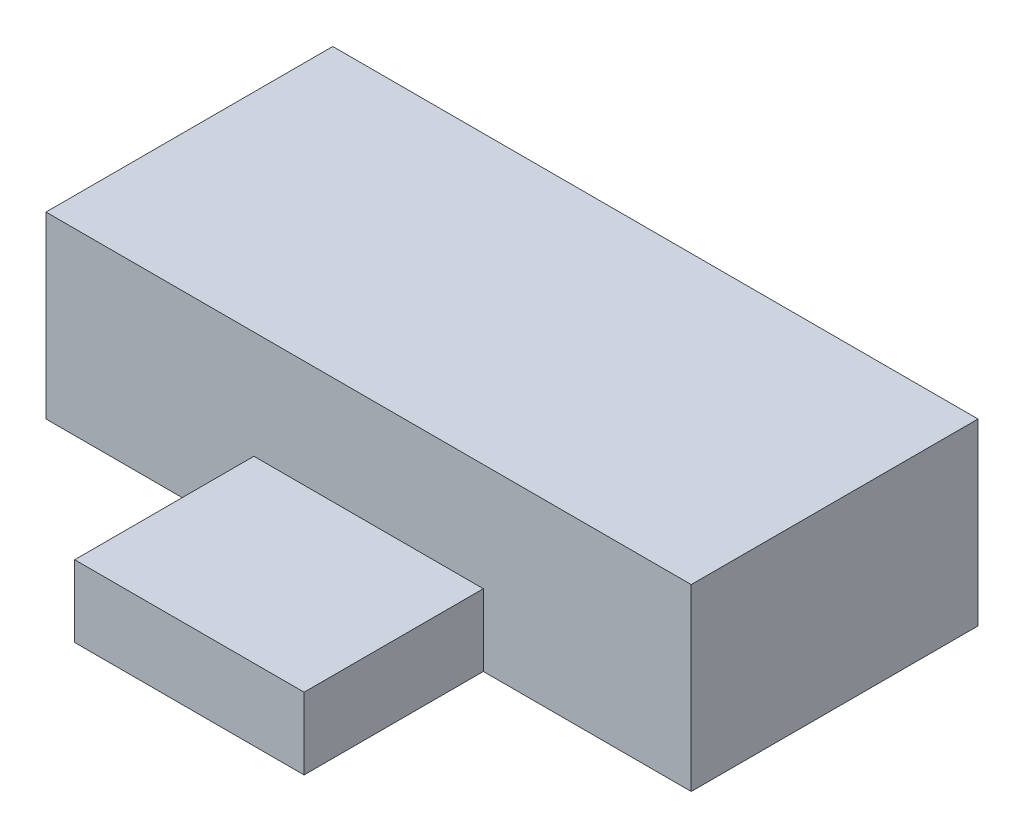
ISO-10303-21;
HEADER;
FILE_DESCRIPTION(('STEP AP214'),'2;1');
FILE_NAME('part.step','',(''),(''),'','','');
FILE_SCHEMA(('AUTOMOTIVE_DESIGN { 1 0 10303 214 1 1 1 1 }'));
ENDSEC;
DATA;
#1=APPLICATION_CONTEXT('core data for automotive mechanical design processes');
#2=APPLICATION_PROTOCOL_DEFINITION('international standard','automotive_design',2000,#1);
#3=PRODUCT_CONTEXT('',#1,'mechanical');
#4=PRODUCT('Part','Part','',(#3));
#5=PRODUCT_RELATED_PRODUCT_CATEGORY('part','',(#4));
#6=PRODUCT_DEFINITION_FORMATION('','',#4);
#7=PRODUCT_DEFINITION_CONTEXT('part definition',#1,'design');
#8=PRODUCT_DEFINITION('design','',#6,#7);
#9=PRODUCT_DEFINITION_SHAPE('','',#8);
#10=(LENGTH_UNIT() NAMED_UNIT(*) SI_UNIT(.MILLI.,.METRE.));
#11=(NAMED_UNIT(*) PLANE_ANGLE_UNIT() SI_UNIT($,.RADIAN.));
#12=(NAMED_UNIT(*) SI_UNIT($,.STERADIAN.) SOLID_ANGLE_UNIT());
#13=UNCERTAINTY_MEASURE_WITH_UNIT(LENGTH_MEASURE(1.E-05),#10,'distance_accuracy_value','');
#14=(GEOMETRIC_REPRESENTATION_CONTEXT(3) GLOBAL_UNCERTAINTY_ASSIGNED_CONTEXT((#13)) GLOBAL_UNIT_ASSIGNED_CONTEXT((#10,
#11,#12)) REPRESENTATION_CONTEXT('',''));
#15=CARTESIAN_POINT('',(0.,0.,0.));
#16=DIRECTION('',(0.,0.,1.));
#17=DIRECTION('',(1.,0.,0.));
#18=AXIS2_PLACEMENT_3D('',#15,#16,#17);
#19=CARTESIAN_POINT('',(-9.,5.,4.));
#20=DIRECTION('',(0.,0.,-1.));
#21=DIRECTION('',(-1.,0.,0.));
#22=AXIS2_PLACEMENT_3D('',#19,#20,#21);
#23=PLANE('',#22);
#24=DIRECTION('',(0.,1.,0.));
#25=VECTOR('',#24,1.);
#26=CARTESIAN_POINT('',(3.2,2.,4.));
#27=LINE('',#26,#25);
#28=CARTESIAN_POINT('',(3.2,0.,4.));
#29=VERTEX_POINT('',#28);
#30=CARTESIAN_POINT('',(3.2,2.,4.));
#31=VERTEX_POINT('',#30);
#32=EDGE_CURVE('E55',#29,#31,#27,.T.);
#33=ORIENTED_EDGE('',*,*,#32,.F.);
#34=DIRECTION('',(1.,0.,0.));
#35=VECTOR('',#34,1.);
#36=CARTESIAN_POINT('',(-9.,0.,4.));
#37=LINE('',#36,#35);
#38=CARTESIAN_POINT('',(9.,0.,4.));
#39=VERTEX_POINT('',#38);
#40=EDGE_CURVE('E143',#29,#39,#37,.T.);
#41=ORIENTED_EDGE('',*,*,#40,.T.);
#42=DIRECTION('',(0.,-1.,0.));
#43=VECTOR('',#42,1.);
#44=CARTESIAN_POINT('',(9.,5.,4.));
#45=LINE('',#44,#43);
#46=CARTESIAN_POINT('',(9.,5.,4.));
#47=VERTEX_POINT('',#46);
#48=EDGE_CURVE('E138',#47,#39,#45,.T.);
#49=ORIENTED_EDGE('',*,*,#48,.F.);
#50=DIRECTION('',(1.,0.,0.));
#51=VECTOR('',#50,1.);
#52=CARTESIAN_POINT('',(-9.,5.,4.));
#53=LINE('',#52,#51);
#54=CARTESIAN_POINT('',(-9.,5.,4.));
#55=VERTEX_POINT('',#54);
#56=EDGE_CURVE('E137',#55,#47,#53,.T.);
#57=ORIENTED_EDGE('',*,*,#56,.F.);
#58=DIRECTION('',(0.,-1.,0.));
#59=VECTOR('',#58,1.);
#60=CARTESIAN_POINT('',(-9.,5.,4.));
#61=LINE('',#60,#59);
#62=CARTESIAN_POINT('',(-9.,0.,4.));
#63=VERTEX_POINT('',#62);
#64=EDGE_CURVE('E153',#55,#63,#61,.T.);
#65=ORIENTED_EDGE('',*,*,#64,.T.);
#66=CARTESIAN_POINT('',(-3.2,0.,4.));
#67=VERTEX_POINT('',#66);
#68=EDGE_CURVE('E133',#63,#67,#37,.T.);
#69=ORIENTED_EDGE('',*,*,#68,.T.);
#70=DIRECTION('',(0.,-1.,0.));
#71=VECTOR('',#70,1.);
#72=CARTESIAN_POINT('',(-3.2,2.,4.));
#73=LINE('',#72,#71);
#74=CARTESIAN_POINT('',(-3.2,2.,4.));
#75=VERTEX_POINT('',#74);
#76=EDGE_CURVE('E117',#75,#67,#73,.T.);
#77=ORIENTED_EDGE('',*,*,#76,.F.);
#78=DIRECTION('',(-1.,0.,0.));
#79=VECTOR('',#78,1.);
#80=CARTESIAN_POINT('',(-3.2,2.,4.));
#81=LINE('',#80,#79);
#82=EDGE_CURVE('E50',#31,#75,#81,.T.);
#83=ORIENTED_EDGE('',*,*,#82,.F.);
#84=EDGE_LOOP('',(#33,#41,#49,#57,#65,#69,#77,#83));
#85=FACE_BOUND('',#84,.T.);
#86=ADVANCED_FACE('F33',(#85),#23,.F.);
#87=CARTESIAN_POINT('',(9.,5.,-4.));
#88=DIRECTION('',(-1.,0.,0.));
#89=DIRECTION('',(0.,0.,1.));
#90=AXIS2_PLACEMENT_3D('',#87,#88,#89);
#91=PLANE('',#90);
#92=DIRECTION('',(0.,0.,-1.));
#93=VECTOR('',#92,1.);
#94=CARTESIAN_POINT('',(9.,0.,-4.));
#95=LINE('',#94,#93);
#96=CARTESIAN_POINT('',(9.,0.,-4.));
#97=VERTEX_POINT('',#96);
#98=EDGE_CURVE('E120',#39,#97,#95,.T.);
#99=ORIENTED_EDGE('',*,*,#98,.T.);
#100=DIRECTION('',(0.,-1.,0.));
#101=VECTOR('',#100,1.);
#102=CARTESIAN_POINT('',(9.,5.,-4.));
#103=LINE('',#102,#101);
#104=CARTESIAN_POINT('',(9.,5.,-4.));
#105=VERTEX_POINT('',#104);
#106=EDGE_CURVE('E11',#105,#97,#103,.T.);
#107=ORIENTED_EDGE('',*,*,#106,.F.);
#108=DIRECTION('',(0.,0.,-1.));
#109=VECTOR('',#108,1.);
#110=CARTESIAN_POINT('',(9.,5.,-4.));
#111=LINE('',#110,#109);
#112=EDGE_CURVE('E129',#47,#105,#111,.T.);
#113=ORIENTED_EDGE('',*,*,#112,.F.);
#114=ORIENTED_EDGE('',*,*,#48,.T.);
#115=EDGE_LOOP('',(#99,#107,#113,#114));
#116=FACE_BOUND('',#115,.T.);
#117=ADVANCED_FACE('F35',(#116),#91,.F.);
#118=CARTESIAN_POINT('',(-9.,5.,-4.));
#119=DIRECTION('',(0.,0.,1.));
#120=DIRECTION('',(1.,0.,0.));
#121=AXIS2_PLACEMENT_3D('',#118,#119,#120);
#122=PLANE('',#121);
#123=DIRECTION('',(-1.,0.,0.));
#124=VECTOR('',#123,1.);
#125=CARTESIAN_POINT('',(-9.,0.,-4.));
#126=LINE('',#125,#124);
#127=CARTESIAN_POINT('',(-9.,0.,-4.));
#128=VERTEX_POINT('',#127);
#129=EDGE_CURVE('E123',#97,#128,#126,.T.);
#130=ORIENTED_EDGE('',*,*,#129,.T.);
#131=DIRECTION('',(0.,-1.,0.));
#132=VECTOR('',#131,1.);
#133=CARTESIAN_POINT('',(-9.,5.,-4.));
#134=LINE('',#133,#132);
#135=CARTESIAN_POINT('',(-9.,5.,-4.));
#136=VERTEX_POINT('',#135);
#137=EDGE_CURVE('E42',#136,#128,#134,.T.);
#138=ORIENTED_EDGE('',*,*,#137,.F.);
#139=DIRECTION('',(-1.,0.,0.));
#140=VECTOR('',#139,1.);
#141=CARTESIAN_POINT('',(-9.,5.,-4.));
#142=LINE('',#141,#140);
#143=EDGE_CURVE('E132',#105,#136,#142,.T.);
#144=ORIENTED_EDGE('',*,*,#143,.F.);
#145=ORIENTED_EDGE('',*,*,#106,.T.);
#146=EDGE_LOOP('',(#130,#138,#144,#145));
#147=FACE_BOUND('',#146,.T.);
#148=ADVANCED_FACE('F169',(#147),#122,.F.);
#149=CARTESIAN_POINT('',(-9.,5.,-4.));
#150=DIRECTION('',(1.,0.,0.));
#151=DIRECTION('',(0.,0.,-1.));
#152=AXIS2_PLACEMENT_3D('',#149,#150,#151);
#153=PLANE('',#152);
#154=DIRECTION('',(0.,0.,1.));
#155=VECTOR('',#154,1.);
#156=CARTESIAN_POINT('',(-9.,0.,-4.));
#157=LINE('',#156,#155);
#158=EDGE_CURVE('E141',#128,#63,#157,.T.);
#159=ORIENTED_EDGE('',*,*,#158,.T.);
#160=ORIENTED_EDGE('',*,*,#64,.F.);
#161=DIRECTION('',(0.,0.,1.));
#162=VECTOR('',#161,1.);
#163=CARTESIAN_POINT('',(-9.,5.,-4.));
#164=LINE('',#163,#162);
#165=EDGE_CURVE('E135',#136,#55,#164,.T.);
#166=ORIENTED_EDGE('',*,*,#165,.F.);
#167=ORIENTED_EDGE('',*,*,#137,.T.);
#168=EDGE_LOOP('',(#159,#160,#166,#167));
#169=FACE_BOUND('',#168,.T.);
#170=ADVANCED_FACE('F181',(#169),#153,.F.);
#171=CARTESIAN_POINT('',(0.,5.,0.));
#172=DIRECTION('',(0.,1.,0.));
#173=DIRECTION('',(0.,0.,1.));
#174=AXIS2_PLACEMENT_3D('',#171,#172,#173);
#175=PLANE('',#174);
#176=ORIENTED_EDGE('',*,*,#112,.T.);
#177=ORIENTED_EDGE('',*,*,#143,.T.);
#178=ORIENTED_EDGE('',*,*,#165,.T.);
#179=ORIENTED_EDGE('',*,*,#56,.T.);
#180=EDGE_LOOP('',(#176,#177,#178,#179));
#181=FACE_BOUND('',#180,.T.);
#182=ADVANCED_FACE('F172',(#181),#175,.T.);
#183=CARTESIAN_POINT('',(0.,0.,0.));
#184=DIRECTION('',(0.,1.,0.));
#185=DIRECTION('',(0.,0.,1.));
#186=AXIS2_PLACEMENT_3D('',#183,#184,#185);
#187=PLANE('',#186);
#188=ORIENTED_EDGE('',*,*,#98,.F.);
#189=ORIENTED_EDGE('',*,*,#40,.F.);
#190=DIRECTION('',(0.,0.,-1.));
#191=VECTOR('',#190,1.);
#192=CARTESIAN_POINT('',(3.2,0.,9.));
#193=LINE('',#192,#191);
#194=CARTESIAN_POINT('',(3.2,0.,9.));
#195=VERTEX_POINT('',#194);
#196=EDGE_CURVE('E262',#195,#29,#193,.T.);
#197=ORIENTED_EDGE('',*,*,#196,.F.);
#198=DIRECTION('',(1.,0.,0.));
#199=VECTOR('',#198,1.);
#200=CARTESIAN_POINT('',(-3.2,0.,9.));
#201=LINE('',#200,#199);
#202=CARTESIAN_POINT('',(-3.2,0.,9.));
#203=VERTEX_POINT('',#202);
#204=EDGE_CURVE('E113',#203,#195,#201,.T.);
#205=ORIENTED_EDGE('',*,*,#204,.F.);
#206=DIRECTION('',(0.,0.,-1.));
#207=VECTOR('',#206,1.);
#208=CARTESIAN_POINT('',(-3.2,0.,9.));
#209=LINE('',#208,#207);
#210=EDGE_CURVE('E125',#203,#67,#209,.T.);
#211=ORIENTED_EDGE('',*,*,#210,.T.);
#212=ORIENTED_EDGE('',*,*,#68,.F.);
#213=ORIENTED_EDGE('',*,*,#158,.F.);
#214=ORIENTED_EDGE('',*,*,#129,.F.);
#215=EDGE_LOOP('',(#188,#189,#197,#205,#211,#212,#213,#214));
#216=FACE_BOUND('',#215,.T.);
#217=ADVANCED_FACE('F165',(#216),#187,.F.);
#218=CARTESIAN_POINT('',(3.2,2.,9.));
#219=DIRECTION('',(-1.,0.,0.));
#220=DIRECTION('',(0.,-1.,0.));
#221=AXIS2_PLACEMENT_3D('',#218,#219,#220);
#222=PLANE('',#221);
#223=ORIENTED_EDGE('',*,*,#32,.T.);
#224=DIRECTION('',(0.,0.,-1.));
#225=VECTOR('',#224,1.);
#226=CARTESIAN_POINT('',(3.2,2.,9.));
#227=LINE('',#226,#225);
#228=CARTESIAN_POINT('',(3.2,2.,9.));
#229=VERTEX_POINT('',#228);
#230=EDGE_CURVE('E102',#229,#31,#227,.T.);
#231=ORIENTED_EDGE('',*,*,#230,.F.);
#232=DIRECTION('',(0.,1.,0.));
#233=VECTOR('',#232,1.);
#234=CARTESIAN_POINT('',(3.2,2.,9.));
#235=LINE('',#234,#233);
#236=EDGE_CURVE('E108',#195,#229,#235,.T.);
#237=ORIENTED_EDGE('',*,*,#236,.F.);
#238=ORIENTED_EDGE('',*,*,#196,.T.);
#239=EDGE_LOOP('',(#223,#231,#237,#238));
#240=FACE_BOUND('',#239,.T.);
#241=ADVANCED_FACE('F119',(#240),#222,.F.);
#242=CARTESIAN_POINT('',(-3.2,2.,9.));
#243=DIRECTION('',(0.,-1.,0.));
#244=DIRECTION('',(0.,0.,-1.));
#245=AXIS2_PLACEMENT_3D('',#242,#243,#244);
#246=PLANE('',#245);
#247=ORIENTED_EDGE('',*,*,#82,.T.);
#248=DIRECTION('',(0.,0.,-1.));
#249=VECTOR('',#248,1.);
#250=CARTESIAN_POINT('',(-3.2,2.,9.));
#251=LINE('',#250,#249);
#252=CARTESIAN_POINT('',(-3.2,2.,9.));
#253=VERTEX_POINT('',#252);
#254=EDGE_CURVE('E104',#253,#75,#251,.T.);
#255=ORIENTED_EDGE('',*,*,#254,.F.);
#256=DIRECTION('',(-1.,0.,0.));
#257=VECTOR('',#256,1.);
#258=CARTESIAN_POINT('',(-3.2,2.,9.));
#259=LINE('',#258,#257);
#260=EDGE_CURVE('E98',#229,#253,#259,.T.);
#261=ORIENTED_EDGE('',*,*,#260,.F.);
#262=ORIENTED_EDGE('',*,*,#230,.T.);
#263=EDGE_LOOP('',(#247,#255,#261,#262));
#264=FACE_BOUND('',#263,.T.);
#265=ADVANCED_FACE('F100',(#264),#246,.F.);
#266=CARTESIAN_POINT('',(-3.2,2.,9.));
#267=DIRECTION('',(1.,0.,0.));
#268=DIRECTION('',(0.,1.,0.));
#269=AXIS2_PLACEMENT_3D('',#266,#267,#268);
#270=PLANE('',#269);
#271=ORIENTED_EDGE('',*,*,#76,.T.);
#272=ORIENTED_EDGE('',*,*,#210,.F.);
#273=DIRECTION('',(0.,-1.,0.));
#274=VECTOR('',#273,1.);
#275=CARTESIAN_POINT('',(-3.2,2.,9.));
#276=LINE('',#275,#274);
#277=EDGE_CURVE('E107',#253,#203,#276,.T.);
#278=ORIENTED_EDGE('',*,*,#277,.F.);
#279=ORIENTED_EDGE('',*,*,#254,.T.);
#280=EDGE_LOOP('',(#271,#272,#278,#279));
#281=FACE_BOUND('',#280,.T.);
#282=ADVANCED_FACE('F215',(#281),#270,.F.);
#283=CARTESIAN_POINT('',(0.,0.,9.));
#284=DIRECTION('',(0.,0.,1.));
#285=DIRECTION('',(1.,0.,0.));
#286=AXIS2_PLACEMENT_3D('',#283,#284,#285);
#287=PLANE('',#286);
#288=ORIENTED_EDGE('',*,*,#236,.T.);
#289=ORIENTED_EDGE('',*,*,#260,.T.);
#290=ORIENTED_EDGE('',*,*,#277,.T.);
#291=ORIENTED_EDGE('',*,*,#204,.T.);
#292=EDGE_LOOP('',(#288,#289,#290,#291));
#293=FACE_BOUND('',#292,.T.);
#294=ADVANCED_FACE('F111',(#293),#287,.T.);
#295=CLOSED_SHELL('',(#86,#117,#148,#170,#182,#217,#241,#265,#282,#294));
#296=MANIFOLD_SOLID_BREP('B2',#295);
#297=ADVANCED_BREP_SHAPE_REPRESENTATION('',(#18,#296),#14);
#298=SHAPE_DEFINITION_REPRESENTATION(#9,#297);
ENDSEC;
END-ISO-10303-21;
